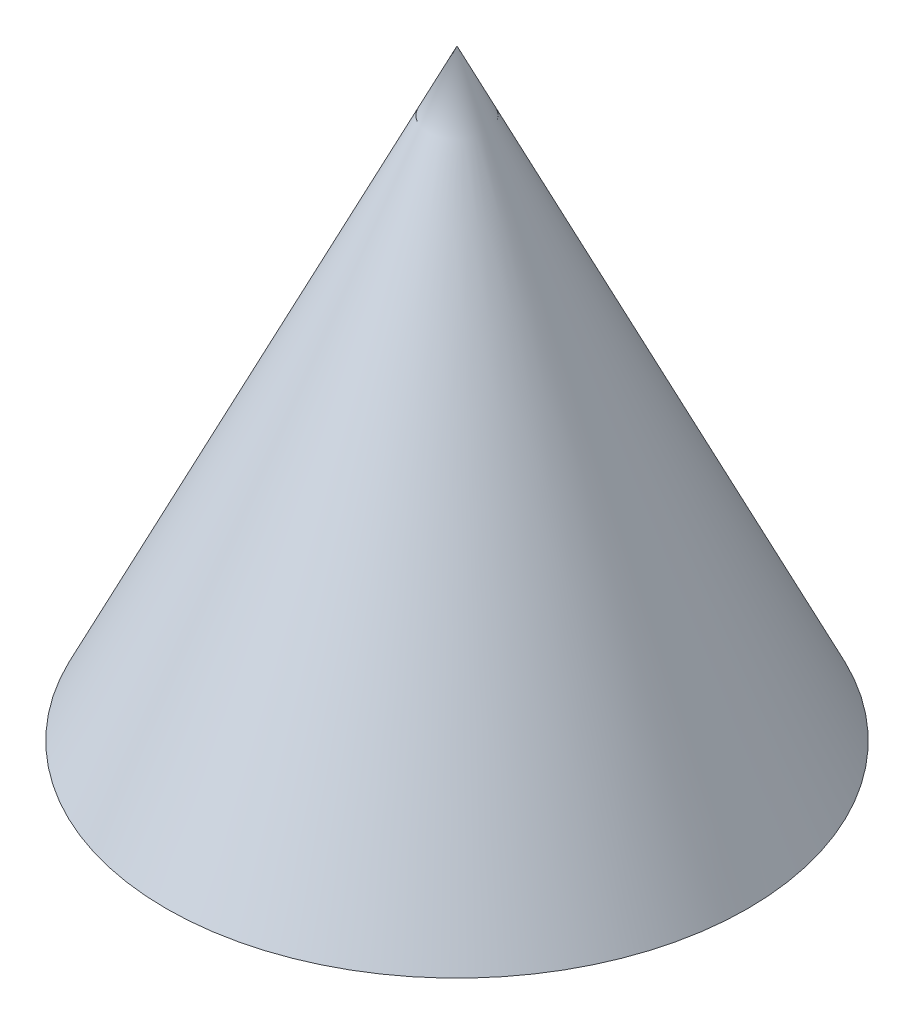
ISO-10303-21;
HEADER;
FILE_DESCRIPTION(('STEP AP214'),'2;1');
FILE_NAME('part.step','',(''),(''),'','','');
FILE_SCHEMA(('AUTOMOTIVE_DESIGN { 1 0 10303 214 1 1 1 1 }'));
ENDSEC;
DATA;
#1=APPLICATION_CONTEXT('core data for automotive mechanical design processes');
#2=APPLICATION_PROTOCOL_DEFINITION('international standard','automotive_design',2000,#1);
#3=PRODUCT_CONTEXT('',#1,'mechanical');
#4=PRODUCT('Part','Part','',(#3));
#5=PRODUCT_RELATED_PRODUCT_CATEGORY('part','',(#4));
#6=PRODUCT_DEFINITION_FORMATION('','',#4);
#7=PRODUCT_DEFINITION_CONTEXT('part definition',#1,'design');
#8=PRODUCT_DEFINITION('design','',#6,#7);
#9=PRODUCT_DEFINITION_SHAPE('','',#8);
#10=(LENGTH_UNIT() NAMED_UNIT(*) SI_UNIT(.MILLI.,.METRE.));
#11=(NAMED_UNIT(*) PLANE_ANGLE_UNIT() SI_UNIT($,.RADIAN.));
#12=(NAMED_UNIT(*) SI_UNIT($,.STERADIAN.) SOLID_ANGLE_UNIT());
#13=UNCERTAINTY_MEASURE_WITH_UNIT(LENGTH_MEASURE(1.E-05),#10,'distance_accuracy_value','');
#14=(GEOMETRIC_REPRESENTATION_CONTEXT(3) GLOBAL_UNCERTAINTY_ASSIGNED_CONTEXT((#13)) GLOBAL_UNIT_ASSIGNED_CONTEXT((#10,
#11,#12)) REPRESENTATION_CONTEXT('',''));
#15=CARTESIAN_POINT('',(0.,0.,0.));
#16=DIRECTION('',(0.,0.,1.));
#17=DIRECTION('',(1.,0.,0.));
#18=AXIS2_PLACEMENT_3D('',#15,#16,#17);
#19=CARTESIAN_POINT('',(-29.,0.,0.));
#20=DIRECTION('',(0.,-1.,0.));
#21=DIRECTION('',(1.,0.,0.));
#22=AXIS2_PLACEMENT_3D('',#19,#20,#21);
#23=PLANE('',#22);
#24=CARTESIAN_POINT('',(0.,0.,0.));
#25=DIRECTION('',(0.,-1.,0.));
#26=DIRECTION('',(1.,0.,0.));
#27=AXIS2_PLACEMENT_3D('',#24,#25,#26);
#28=CIRCLE('',#27,29.);
#29=CARTESIAN_POINT('',(29.,0.,0.));
#30=VERTEX_POINT('',#29);
#31=EDGE_CURVE('E11',#30,#30,#28,.F.);
#32=ORIENTED_EDGE('',*,*,#31,.F.);
#33=EDGE_LOOP('',(#32));
#34=FACE_BOUND('',#33,.T.);
#35=ADVANCED_FACE('F17',(#34),#23,.T.);
#36=CARTESIAN_POINT('',(0.,0.,0.));
#37=DIRECTION('',(0.,-1.,0.));
#38=DIRECTION('',(1.,0.,0.));
#39=AXIS2_PLACEMENT_3D('',#36,#37,#38);
#40=CONICAL_SURFACE('',#39,29.,0.450225596262178);
#41=CARTESIAN_POINT('',(0.,59.9999999997759,0.));
#42=VERTEX_POINT('',#41);
#43=VERTEX_LOOP('',#42);
#44=FACE_BOUND('',#43,.T.);
#45=ORIENTED_EDGE('',*,*,#31,.T.);
#46=EDGE_LOOP('',(#45));
#47=FACE_BOUND('',#46,.T.);
#48=ADVANCED_FACE('F24',(#44,#47),#40,.T.);
#49=CLOSED_SHELL('',(#35,#48));
#50=MANIFOLD_SOLID_BREP('B1',#49);
#51=ADVANCED_BREP_SHAPE_REPRESENTATION('',(#18,#50),#14);
#52=SHAPE_DEFINITION_REPRESENTATION(#9,#51);
ENDSEC;
END-ISO-10303-21;
